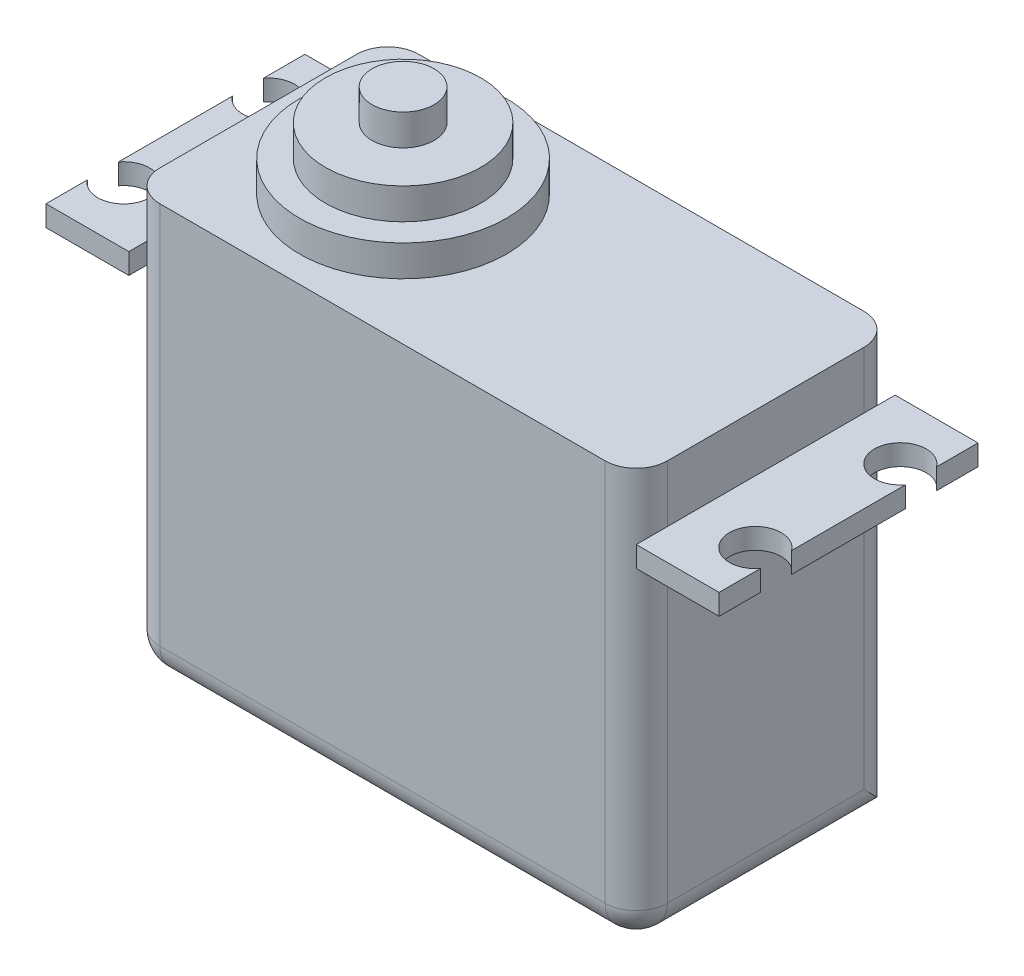
ISO-10303-21;
HEADER;
FILE_DESCRIPTION(('STEP AP214'),'2;1');
FILE_NAME('part.step','',(''),(''),'','','');
FILE_SCHEMA(('AUTOMOTIVE_DESIGN { 1 0 10303 214 1 1 1 1 }'));
ENDSEC;
DATA;
#1=APPLICATION_CONTEXT('core data for automotive mechanical design processes');
#2=APPLICATION_PROTOCOL_DEFINITION('international standard','automotive_design',2000,#1);
#3=PRODUCT_CONTEXT('',#1,'mechanical');
#4=PRODUCT('Part','Part','',(#3));
#5=PRODUCT_RELATED_PRODUCT_CATEGORY('part','',(#4));
#6=PRODUCT_DEFINITION_FORMATION('','',#4);
#7=PRODUCT_DEFINITION_CONTEXT('part definition',#1,'design');
#8=PRODUCT_DEFINITION('design','',#6,#7);
#9=PRODUCT_DEFINITION_SHAPE('','',#8);
#10=(LENGTH_UNIT() NAMED_UNIT(*) SI_UNIT(.MILLI.,.METRE.));
#11=(NAMED_UNIT(*) PLANE_ANGLE_UNIT() SI_UNIT($,.RADIAN.));
#12=(NAMED_UNIT(*) SI_UNIT($,.STERADIAN.) SOLID_ANGLE_UNIT());
#13=UNCERTAINTY_MEASURE_WITH_UNIT(LENGTH_MEASURE(1.E-05),#10,'distance_accuracy_value','');
#14=(GEOMETRIC_REPRESENTATION_CONTEXT(3) GLOBAL_UNCERTAINTY_ASSIGNED_CONTEXT((#13)) GLOBAL_UNIT_ASSIGNED_CONTEXT((#10,
#11,#12)) REPRESENTATION_CONTEXT('',''));
#15=CARTESIAN_POINT('',(0.,0.,0.));
#16=DIRECTION('',(0.,0.,1.));
#17=DIRECTION('',(1.,0.,0.));
#18=AXIS2_PLACEMENT_3D('',#15,#16,#17);
#19=CARTESIAN_POINT('',(24.5,-20.,25.));
#20=DIRECTION('',(-1.,0.,0.));
#21=DIRECTION('',(0.,0.,1.));
#22=AXIS2_PLACEMENT_3D('',#19,#20,#21);
#23=PLANE('',#22);
#24=DIRECTION('',(0.,0.,1.));
#25=VECTOR('',#24,1.);
#26=CARTESIAN_POINT('',(24.5,14.5,0.));
#27=LINE('',#26,#25);
#28=CARTESIAN_POINT('',(24.5,14.5,3.));
#29=VERTEX_POINT('',#28);
#30=CARTESIAN_POINT('',(24.5,14.5,22.));
#31=VERTEX_POINT('',#30);
#32=EDGE_CURVE('E281',#29,#31,#27,.T.);
#33=ORIENTED_EDGE('',*,*,#32,.F.);
#34=DIRECTION('',(0.,1.,0.));
#35=VECTOR('',#34,1.);
#36=CARTESIAN_POINT('',(24.5,-20.,3.));
#37=LINE('',#36,#35);
#38=CARTESIAN_POINT('',(24.5,20.,3.));
#39=VERTEX_POINT('',#38);
#40=EDGE_CURVE('E420',#29,#39,#37,.T.);
#41=ORIENTED_EDGE('',*,*,#40,.T.);
#42=DIRECTION('',(0.,0.,-1.));
#43=VECTOR('',#42,1.);
#44=CARTESIAN_POINT('',(24.5,20.,25.));
#45=LINE('',#44,#43);
#46=CARTESIAN_POINT('',(24.5,20.,22.));
#47=VERTEX_POINT('',#46);
#48=EDGE_CURVE('E408',#47,#39,#45,.T.);
#49=ORIENTED_EDGE('',*,*,#48,.F.);
#50=DIRECTION('',(0.,1.,0.));
#51=VECTOR('',#50,1.);
#52=CARTESIAN_POINT('',(24.5,-20.,22.));
#53=LINE('',#52,#51);
#54=EDGE_CURVE('E415',#47,#31,#53,.F.);
#55=ORIENTED_EDGE('',*,*,#54,.T.);
#56=EDGE_LOOP('',(#33,#41,#49,#55));
#57=FACE_BOUND('',#56,.T.);
#58=ADVANCED_FACE('F35',(#57),#23,.F.);
#59=CARTESIAN_POINT('',(-24.5,-20.,25.));
#60=DIRECTION('',(1.,0.,0.));
#61=DIRECTION('',(0.,0.,-1.));
#62=AXIS2_PLACEMENT_3D('',#59,#60,#61);
#63=PLANE('',#62);
#64=DIRECTION('',(0.,0.,-1.));
#65=VECTOR('',#64,1.);
#66=CARTESIAN_POINT('',(-24.5,14.5,0.));
#67=LINE('',#66,#65);
#68=CARTESIAN_POINT('',(-24.5,14.5,22.));
#69=VERTEX_POINT('',#68);
#70=CARTESIAN_POINT('',(-24.5,14.5,3.));
#71=VERTEX_POINT('',#70);
#72=EDGE_CURVE('E341',#69,#71,#67,.T.);
#73=ORIENTED_EDGE('',*,*,#72,.F.);
#74=DIRECTION('',(0.,-1.,0.));
#75=VECTOR('',#74,1.);
#76=CARTESIAN_POINT('',(-24.5,20.,22.));
#77=LINE('',#76,#75);
#78=CARTESIAN_POINT('',(-24.5,20.,22.));
#79=VERTEX_POINT('',#78);
#80=EDGE_CURVE('E442',#69,#79,#77,.F.);
#81=ORIENTED_EDGE('',*,*,#80,.T.);
#82=DIRECTION('',(0.,0.,-1.));
#83=VECTOR('',#82,1.);
#84=CARTESIAN_POINT('',(-24.5,20.,25.));
#85=LINE('',#84,#83);
#86=CARTESIAN_POINT('',(-24.5,20.,3.));
#87=VERTEX_POINT('',#86);
#88=EDGE_CURVE('E400',#79,#87,#85,.T.);
#89=ORIENTED_EDGE('',*,*,#88,.T.);
#90=DIRECTION('',(0.,-1.,0.));
#91=VECTOR('',#90,1.);
#92=CARTESIAN_POINT('',(-24.5,-20.,3.));
#93=LINE('',#92,#91);
#94=EDGE_CURVE('E450',#87,#71,#93,.T.);
#95=ORIENTED_EDGE('',*,*,#94,.T.);
#96=EDGE_LOOP('',(#73,#81,#89,#95));
#97=FACE_BOUND('',#96,.T.);
#98=ADVANCED_FACE('F570',(#97),#63,.F.);
#99=CARTESIAN_POINT('',(-24.5,-17.,22.));
#100=VERTEX_POINT('',#99);
#101=CARTESIAN_POINT('',(-24.5,12.5,22.));
#102=VERTEX_POINT('',#101);
#103=EDGE_CURVE('E443',#100,#102,#77,.F.);
#104=ORIENTED_EDGE('',*,*,#103,.T.);
#105=DIRECTION('',(0.,0.,-1.));
#106=VECTOR('',#105,1.);
#107=CARTESIAN_POINT('',(-24.5,12.5,0.));
#108=LINE('',#107,#106);
#109=CARTESIAN_POINT('',(-24.5,12.5,3.));
#110=VERTEX_POINT('',#109);
#111=EDGE_CURVE('E314',#102,#110,#108,.T.);
#112=ORIENTED_EDGE('',*,*,#111,.T.);
#113=CARTESIAN_POINT('',(-24.5,-17.,3.));
#114=VERTEX_POINT('',#113);
#115=EDGE_CURVE('E449',#110,#114,#93,.T.);
#116=ORIENTED_EDGE('',*,*,#115,.T.);
#117=DIRECTION('',(0.,0.,-1.));
#118=VECTOR('',#117,1.);
#119=CARTESIAN_POINT('',(-24.5,-17.,25.));
#120=LINE('',#119,#118);
#121=EDGE_CURVE('E446',#114,#100,#120,.F.);
#122=ORIENTED_EDGE('',*,*,#121,.T.);
#123=EDGE_LOOP('',(#104,#112,#116,#122));
#124=FACE_BOUND('',#123,.T.);
#125=ADVANCED_FACE('F528',(#124),#63,.F.);
#126=CARTESIAN_POINT('',(24.5,-20.,25.));
#127=DIRECTION('',(0.,1.,0.));
#128=DIRECTION('',(-1.,0.,0.));
#129=AXIS2_PLACEMENT_3D('',#126,#127,#128);
#130=PLANE('',#129);
#131=DIRECTION('',(1.,0.,0.));
#132=VECTOR('',#131,1.);
#133=CARTESIAN_POINT('',(24.5,-20.,0.));
#134=LINE('',#133,#132);
#135=CARTESIAN_POINT('',(-21.5,-20.,0.));
#136=VERTEX_POINT('',#135);
#137=CARTESIAN_POINT('',(21.5,-20.,0.));
#138=VERTEX_POINT('',#137);
#139=EDGE_CURVE('E396',#136,#138,#134,.T.);
#140=ORIENTED_EDGE('',*,*,#139,.T.);
#141=DIRECTION('',(0.,0.,-1.));
#142=VECTOR('',#141,1.);
#143=CARTESIAN_POINT('',(21.5,-20.,25.));
#144=LINE('',#143,#142);
#145=CARTESIAN_POINT('',(21.5,-20.,22.));
#146=VERTEX_POINT('',#145);
#147=EDGE_CURVE('E428',#138,#146,#144,.F.);
#148=ORIENTED_EDGE('',*,*,#147,.T.);
#149=DIRECTION('',(1.,0.,0.));
#150=VECTOR('',#149,1.);
#151=CARTESIAN_POINT('',(-24.5,-20.,22.));
#152=LINE('',#151,#150);
#153=CARTESIAN_POINT('',(-21.5,-20.,22.));
#154=VERTEX_POINT('',#153);
#155=EDGE_CURVE('E423',#146,#154,#152,.F.);
#156=ORIENTED_EDGE('',*,*,#155,.T.);
#157=DIRECTION('',(0.,0.,-1.));
#158=VECTOR('',#157,1.);
#159=CARTESIAN_POINT('',(-21.5,-20.,25.));
#160=LINE('',#159,#158);
#161=EDGE_CURVE('E426',#154,#136,#160,.T.);
#162=ORIENTED_EDGE('',*,*,#161,.T.);
#163=EDGE_LOOP('',(#140,#148,#156,#162));
#164=FACE_BOUND('',#163,.T.);
#165=ADVANCED_FACE('F505',(#164),#130,.F.);
#166=CARTESIAN_POINT('',(24.5,-17.,3.));
#167=VERTEX_POINT('',#166);
#168=CARTESIAN_POINT('',(24.5,12.5,3.));
#169=VERTEX_POINT('',#168);
#170=EDGE_CURVE('E421',#167,#169,#37,.T.);
#171=ORIENTED_EDGE('',*,*,#170,.T.);
#172=DIRECTION('',(0.,0.,1.));
#173=VECTOR('',#172,1.);
#174=CARTESIAN_POINT('',(24.5,12.5,0.));
#175=LINE('',#174,#173);
#176=CARTESIAN_POINT('',(24.5,12.5,22.));
#177=VERTEX_POINT('',#176);
#178=EDGE_CURVE('E52',#169,#177,#175,.T.);
#179=ORIENTED_EDGE('',*,*,#178,.T.);
#180=CARTESIAN_POINT('',(24.5,-17.,22.));
#181=VERTEX_POINT('',#180);
#182=EDGE_CURVE('E414',#177,#181,#53,.F.);
#183=ORIENTED_EDGE('',*,*,#182,.T.);
#184=DIRECTION('',(0.,0.,-1.));
#185=VECTOR('',#184,1.);
#186=CARTESIAN_POINT('',(24.5,-17.,25.));
#187=LINE('',#186,#185);
#188=EDGE_CURVE('E417',#181,#167,#187,.T.);
#189=ORIENTED_EDGE('',*,*,#188,.T.);
#190=EDGE_LOOP('',(#171,#179,#183,#189));
#191=FACE_BOUND('',#190,.T.);
#192=ADVANCED_FACE('F620',(#191),#23,.F.);
#193=CARTESIAN_POINT('',(24.5,20.,25.));
#194=DIRECTION('',(0.,-1.,0.));
#195=DIRECTION('',(1.,0.,0.));
#196=AXIS2_PLACEMENT_3D('',#193,#194,#195);
#197=PLANE('',#196);
#198=CARTESIAN_POINT('',(-10.5481960435598,20.,12.4687923193977));
#199=DIRECTION('',(0.,-1.,0.));
#200=DIRECTION('',(1.,0.,0.));
#201=AXIS2_PLACEMENT_3D('',#198,#199,#200);
#202=CIRCLE('',#201,10.);
#203=CARTESIAN_POINT('',(-0.548196043559839,20.,12.4687923193977));
#204=VERTEX_POINT('',#203);
#205=EDGE_CURVE('E411',#204,#204,#202,.F.);
#206=ORIENTED_EDGE('',*,*,#205,.F.);
#207=EDGE_LOOP('',(#206));
#208=FACE_BOUND('',#207,.T.);
#209=ORIENTED_EDGE('',*,*,#48,.T.);
#210=CARTESIAN_POINT('',(21.5,20.,3.));
#211=DIRECTION('',(0.,-1.,0.));
#212=DIRECTION('',(1.,0.,0.));
#213=AXIS2_PLACEMENT_3D('',#210,#211,#212);
#214=CIRCLE('',#213,3.);
#215=CARTESIAN_POINT('',(21.5,20.,0.));
#216=VERTEX_POINT('',#215);
#217=EDGE_CURVE('E436',#39,#216,#214,.F.);
#218=ORIENTED_EDGE('',*,*,#217,.T.);
#219=DIRECTION('',(-1.,0.,0.));
#220=VECTOR('',#219,1.);
#221=CARTESIAN_POINT('',(24.5,20.,0.));
#222=LINE('',#221,#220);
#223=CARTESIAN_POINT('',(-21.5,20.,0.));
#224=VERTEX_POINT('',#223);
#225=EDGE_CURVE('E401',#216,#224,#222,.T.);
#226=ORIENTED_EDGE('',*,*,#225,.T.);
#227=CARTESIAN_POINT('',(-21.5,20.,3.));
#228=DIRECTION('',(0.,-1.,0.));
#229=DIRECTION('',(1.,0.,0.));
#230=AXIS2_PLACEMENT_3D('',#227,#228,#229);
#231=CIRCLE('',#230,3.);
#232=EDGE_CURVE('E434',#224,#87,#231,.F.);
#233=ORIENTED_EDGE('',*,*,#232,.T.);
#234=ORIENTED_EDGE('',*,*,#88,.F.);
#235=CARTESIAN_POINT('',(-21.5,20.,22.));
#236=DIRECTION('',(0.,-1.,0.));
#237=DIRECTION('',(1.,0.,0.));
#238=AXIS2_PLACEMENT_3D('',#235,#236,#237);
#239=CIRCLE('',#238,3.);
#240=CARTESIAN_POINT('',(-21.5,20.,25.));
#241=VERTEX_POINT('',#240);
#242=EDGE_CURVE('E430',#79,#241,#239,.F.);
#243=ORIENTED_EDGE('',*,*,#242,.T.);
#244=DIRECTION('',(-1.,0.,0.));
#245=VECTOR('',#244,1.);
#246=CARTESIAN_POINT('',(24.5,20.,25.));
#247=LINE('',#246,#245);
#248=CARTESIAN_POINT('',(21.5,20.,25.));
#249=VERTEX_POINT('',#248);
#250=EDGE_CURVE('E397',#249,#241,#247,.T.);
#251=ORIENTED_EDGE('',*,*,#250,.F.);
#252=CARTESIAN_POINT('',(21.5,20.,22.));
#253=DIRECTION('',(0.,-1.,0.));
#254=DIRECTION('',(1.,0.,0.));
#255=AXIS2_PLACEMENT_3D('',#252,#253,#254);
#256=CIRCLE('',#255,3.);
#257=EDGE_CURVE('E432',#249,#47,#256,.F.);
#258=ORIENTED_EDGE('',*,*,#257,.T.);
#259=EDGE_LOOP('',(#209,#218,#226,#233,#234,#243,#251,#258));
#260=FACE_BOUND('',#259,.T.);
#261=ADVANCED_FACE('F494',(#208,#260),#197,.F.);
#262=CARTESIAN_POINT('',(0.,0.,25.));
#263=DIRECTION('',(0.,0.,1.));
#264=DIRECTION('',(1.,0.,0.));
#265=AXIS2_PLACEMENT_3D('',#262,#263,#264);
#266=PLANE('',#265);
#267=DIRECTION('',(1.,0.,0.));
#268=VECTOR('',#267,1.);
#269=CARTESIAN_POINT('',(24.5,-17.,25.));
#270=LINE('',#269,#268);
#271=CARTESIAN_POINT('',(-21.5,-17.,25.));
#272=VERTEX_POINT('',#271);
#273=CARTESIAN_POINT('',(21.5,-17.,25.));
#274=VERTEX_POINT('',#273);
#275=EDGE_CURVE('E44',#272,#274,#270,.T.);
#276=ORIENTED_EDGE('',*,*,#275,.T.);
#277=DIRECTION('',(0.,1.,0.));
#278=VECTOR('',#277,1.);
#279=CARTESIAN_POINT('',(21.5,20.,25.));
#280=LINE('',#279,#278);
#281=EDGE_CURVE('E11',#274,#249,#280,.T.);
#282=ORIENTED_EDGE('',*,*,#281,.T.);
#283=ORIENTED_EDGE('',*,*,#250,.T.);
#284=DIRECTION('',(0.,-1.,0.));
#285=VECTOR('',#284,1.);
#286=CARTESIAN_POINT('',(-21.5,-20.,25.));
#287=LINE('',#286,#285);
#288=EDGE_CURVE('E453',#241,#272,#287,.T.);
#289=ORIENTED_EDGE('',*,*,#288,.T.);
#290=EDGE_LOOP('',(#276,#282,#283,#289));
#291=FACE_BOUND('',#290,.T.);
#292=ADVANCED_FACE('F574',(#291),#266,.T.);
#293=CARTESIAN_POINT('',(0.,0.,0.));
#294=DIRECTION('',(0.,0.,1.));
#295=DIRECTION('',(1.,0.,0.));
#296=AXIS2_PLACEMENT_3D('',#293,#294,#295);
#297=PLANE('',#296);
#298=ORIENTED_EDGE('',*,*,#225,.F.);
#299=DIRECTION('',(0.,1.,0.));
#300=VECTOR('',#299,1.);
#301=CARTESIAN_POINT('',(21.5,0.,0.));
#302=LINE('',#301,#300);
#303=EDGE_CURVE('E440',#216,#138,#302,.F.);
#304=ORIENTED_EDGE('',*,*,#303,.T.);
#305=ORIENTED_EDGE('',*,*,#139,.F.);
#306=DIRECTION('',(0.,-1.,0.));
#307=VECTOR('',#306,1.);
#308=CARTESIAN_POINT('',(-21.5,0.,0.));
#309=LINE('',#308,#307);
#310=EDGE_CURVE('E438',#136,#224,#309,.F.);
#311=ORIENTED_EDGE('',*,*,#310,.T.);
#312=EDGE_LOOP('',(#298,#304,#305,#311));
#313=FACE_BOUND('',#312,.T.);
#314=ADVANCED_FACE('F491',(#313),#297,.F.);
#315=CARTESIAN_POINT('',(-10.5481960435598,23.,12.4687923193977));
#316=DIRECTION('',(0.,-1.,0.));
#317=DIRECTION('',(1.,0.,0.));
#318=AXIS2_PLACEMENT_3D('',#315,#316,#317);
#319=CYLINDRICAL_SURFACE('',#318,10.);
#320=CARTESIAN_POINT('',(-10.5481960435598,23.,12.4687923193977));
#321=DIRECTION('',(0.,1.,0.));
#322=DIRECTION('',(-1.,0.,0.));
#323=AXIS2_PLACEMENT_3D('',#320,#321,#322);
#324=CIRCLE('',#323,10.);
#325=CARTESIAN_POINT('',(-20.5481960435598,23.,12.4687923193977));
#326=VERTEX_POINT('',#325);
#327=EDGE_CURVE('E391',#326,#326,#324,.T.);
#328=ORIENTED_EDGE('',*,*,#327,.F.);
#329=EDGE_LOOP('',(#328));
#330=FACE_BOUND('',#329,.T.);
#331=ORIENTED_EDGE('',*,*,#205,.T.);
#332=EDGE_LOOP('',(#331));
#333=FACE_BOUND('',#332,.T.);
#334=ADVANCED_FACE('F683',(#330,#333),#319,.T.);
#335=CARTESIAN_POINT('',(-10.5481960435598,23.,12.4687923193977));
#336=DIRECTION('',(0.,1.,0.));
#337=DIRECTION('',(-1.,0.,0.));
#338=AXIS2_PLACEMENT_3D('',#335,#336,#337);
#339=PLANE('',#338);
#340=CARTESIAN_POINT('',(-10.5481960435598,23.,12.4687923193977));
#341=DIRECTION('',(0.,1.,0.));
#342=DIRECTION('',(-1.,0.,0.));
#343=AXIS2_PLACEMENT_3D('',#340,#341,#342);
#344=CIRCLE('',#343,7.5);
#345=CARTESIAN_POINT('',(-18.0481960435598,23.,12.4687923193977));
#346=VERTEX_POINT('',#345);
#347=EDGE_CURVE('E384',#346,#346,#344,.T.);
#348=ORIENTED_EDGE('',*,*,#347,.F.);
#349=EDGE_LOOP('',(#348));
#350=FACE_BOUND('',#349,.T.);
#351=ORIENTED_EDGE('',*,*,#327,.T.);
#352=EDGE_LOOP('',(#351));
#353=FACE_BOUND('',#352,.T.);
#354=ADVANCED_FACE('F679',(#350,#353),#339,.T.);
#355=CARTESIAN_POINT('',(-10.5481960435598,26.,12.4687923193977));
#356=DIRECTION('',(0.,-1.,0.));
#357=DIRECTION('',(1.,0.,0.));
#358=AXIS2_PLACEMENT_3D('',#355,#356,#357);
#359=CYLINDRICAL_SURFACE('',#358,7.5);
#360=CARTESIAN_POINT('',(-10.5481960435598,26.,12.4687923193977));
#361=DIRECTION('',(0.,1.,0.));
#362=DIRECTION('',(-1.,0.,0.));
#363=AXIS2_PLACEMENT_3D('',#360,#361,#362);
#364=CIRCLE('',#363,7.5);
#365=CARTESIAN_POINT('',(-18.0481960435598,26.,12.4687923193977));
#366=VERTEX_POINT('',#365);
#367=EDGE_CURVE('E388',#366,#366,#364,.T.);
#368=ORIENTED_EDGE('',*,*,#367,.F.);
#369=EDGE_LOOP('',(#368));
#370=FACE_BOUND('',#369,.T.);
#371=ORIENTED_EDGE('',*,*,#347,.T.);
#372=EDGE_LOOP('',(#371));
#373=FACE_BOUND('',#372,.T.);
#374=ADVANCED_FACE('F675',(#370,#373),#359,.T.);
#375=CARTESIAN_POINT('',(-10.5481960435598,26.,12.4687923193977));
#376=DIRECTION('',(0.,1.,0.));
#377=DIRECTION('',(-1.,0.,0.));
#378=AXIS2_PLACEMENT_3D('',#375,#376,#377);
#379=PLANE('',#378);
#380=CARTESIAN_POINT('',(-10.5481960435598,26.,12.4687923193977));
#381=DIRECTION('',(0.,1.,0.));
#382=DIRECTION('',(-1.,0.,0.));
#383=AXIS2_PLACEMENT_3D('',#380,#381,#382);
#384=CIRCLE('',#383,3.);
#385=CARTESIAN_POINT('',(-13.5481960435598,26.,12.4687923193977));
#386=VERTEX_POINT('',#385);
#387=EDGE_CURVE('E385',#386,#386,#384,.T.);
#388=ORIENTED_EDGE('',*,*,#387,.F.);
#389=EDGE_LOOP('',(#388));
#390=FACE_BOUND('',#389,.T.);
#391=ORIENTED_EDGE('',*,*,#367,.T.);
#392=EDGE_LOOP('',(#391));
#393=FACE_BOUND('',#392,.T.);
#394=ADVANCED_FACE('F667',(#390,#393),#379,.T.);
#395=CARTESIAN_POINT('',(-10.5481960435598,29.,12.4687923193977));
#396=DIRECTION('',(0.,-1.,0.));
#397=DIRECTION('',(1.,0.,0.));
#398=AXIS2_PLACEMENT_3D('',#395,#396,#397);
#399=CYLINDRICAL_SURFACE('',#398,3.);
#400=CARTESIAN_POINT('',(-10.5481960435598,29.,12.4687923193977));
#401=DIRECTION('',(0.,1.,0.));
#402=DIRECTION('',(-1.,0.,0.));
#403=AXIS2_PLACEMENT_3D('',#400,#401,#402);
#404=CIRCLE('',#403,3.);
#405=CARTESIAN_POINT('',(-13.5481960435598,29.,12.4687923193977));
#406=VERTEX_POINT('',#405);
#407=EDGE_CURVE('E381',#406,#406,#404,.T.);
#408=ORIENTED_EDGE('',*,*,#407,.F.);
#409=EDGE_LOOP('',(#408));
#410=FACE_BOUND('',#409,.T.);
#411=ORIENTED_EDGE('',*,*,#387,.T.);
#412=EDGE_LOOP('',(#411));
#413=FACE_BOUND('',#412,.T.);
#414=ADVANCED_FACE('F661',(#410,#413),#399,.T.);
#415=CARTESIAN_POINT('',(-10.5481960435598,29.,12.4687923193977));
#416=DIRECTION('',(0.,1.,0.));
#417=DIRECTION('',(-1.,0.,0.));
#418=AXIS2_PLACEMENT_3D('',#415,#416,#417);
#419=PLANE('',#418);
#420=ORIENTED_EDGE('',*,*,#407,.T.);
#421=EDGE_LOOP('',(#420));
#422=FACE_BOUND('',#421,.T.);
#423=ADVANCED_FACE('F657',(#422),#419,.T.);
#424=CARTESIAN_POINT('',(-21.5,-20.,3.));
#425=DIRECTION('',(0.,-1.,0.));
#426=DIRECTION('',(0.,0.,-1.));
#427=AXIS2_PLACEMENT_3D('',#424,#425,#426);
#428=CYLINDRICAL_SURFACE('',#427,3.);
#429=ORIENTED_EDGE('',*,*,#232,.F.);
#430=ORIENTED_EDGE('',*,*,#310,.F.);
#431=CARTESIAN_POINT('',(-21.5,-17.,3.));
#432=DIRECTION('',(0.,-0.707106781186547,0.707106781186547));
#433=DIRECTION('',(0.,-0.707106781186547,-0.707106781186547));
#434=AXIS2_PLACEMENT_3D('',#431,#432,#433);
#435=ELLIPSE('',#434,4.24264068711928,3.);
#436=EDGE_CURVE('E39',#114,#136,#435,.T.);
#437=ORIENTED_EDGE('',*,*,#436,.F.);
#438=ORIENTED_EDGE('',*,*,#115,.F.);
#439=DIRECTION('',(0.,-1.,0.));
#440=VECTOR('',#439,1.);
#441=CARTESIAN_POINT('',(-24.5,-20.,3.));
#442=LINE('',#441,#440);
#443=EDGE_CURVE('E364',#110,#71,#442,.F.);
#444=ORIENTED_EDGE('',*,*,#443,.T.);
#445=ORIENTED_EDGE('',*,*,#94,.F.);
#446=EDGE_LOOP('',(#429,#430,#437,#438,#444,#445));
#447=FACE_BOUND('',#446,.T.);
#448=ADVANCED_FACE('F37',(#447),#428,.T.);
#449=CARTESIAN_POINT('',(-21.5,-17.,25.));
#450=DIRECTION('',(0.,0.,-1.));
#451=DIRECTION('',(-1.,0.,0.));
#452=AXIS2_PLACEMENT_3D('',#449,#450,#451);
#453=CYLINDRICAL_SURFACE('',#452,3.);
#454=ORIENTED_EDGE('',*,*,#436,.T.);
#455=ORIENTED_EDGE('',*,*,#161,.F.);
#456=CARTESIAN_POINT('',(-21.5,-17.,22.));
#457=DIRECTION('',(0.,0.,1.));
#458=DIRECTION('',(1.,0.,0.));
#459=AXIS2_PLACEMENT_3D('',#456,#457,#458);
#460=CIRCLE('',#459,3.);
#461=EDGE_CURVE('E471',#100,#154,#460,.T.);
#462=ORIENTED_EDGE('',*,*,#461,.F.);
#463=ORIENTED_EDGE('',*,*,#121,.F.);
#464=EDGE_LOOP('',(#454,#455,#462,#463));
#465=FACE_BOUND('',#464,.T.);
#466=ADVANCED_FACE('F481',(#465),#453,.T.);
#467=CARTESIAN_POINT('',(-21.5,0.,22.));
#468=DIRECTION('',(0.,1.,0.));
#469=DIRECTION('',(0.,0.,1.));
#470=AXIS2_PLACEMENT_3D('',#467,#468,#469);
#471=CYLINDRICAL_SURFACE('',#470,3.);
#472=ORIENTED_EDGE('',*,*,#242,.F.);
#473=ORIENTED_EDGE('',*,*,#80,.F.);
#474=EDGE_CURVE('E447',#102,#69,#77,.F.);
#475=ORIENTED_EDGE('',*,*,#474,.F.);
#476=ORIENTED_EDGE('',*,*,#103,.F.);
#477=CARTESIAN_POINT('',(-21.5,-17.,22.));
#478=DIRECTION('',(0.,-1.,0.));
#479=DIRECTION('',(0.,0.,-1.));
#480=AXIS2_PLACEMENT_3D('',#477,#478,#479);
#481=CIRCLE('',#480,3.);
#482=EDGE_CURVE('E469',#272,#100,#481,.T.);
#483=ORIENTED_EDGE('',*,*,#482,.F.);
#484=ORIENTED_EDGE('',*,*,#288,.F.);
#485=EDGE_LOOP('',(#472,#473,#475,#476,#483,#484));
#486=FACE_BOUND('',#485,.T.);
#487=ADVANCED_FACE('F524',(#486),#471,.T.);
#488=CARTESIAN_POINT('',(-21.5,-17.,22.));
#489=DIRECTION('',(0.,0.,1.));
#490=DIRECTION('',(1.,0.,0.));
#491=AXIS2_PLACEMENT_3D('',#488,#489,#490);
#492=SPHERICAL_SURFACE('',#491,3.);
#493=ORIENTED_EDGE('',*,*,#482,.T.);
#494=ORIENTED_EDGE('',*,*,#461,.T.);
#495=CARTESIAN_POINT('',(-21.5,-17.,22.));
#496=DIRECTION('',(-1.,0.,0.));
#497=DIRECTION('',(0.,0.,1.));
#498=AXIS2_PLACEMENT_3D('',#495,#496,#497);
#499=CIRCLE('',#498,3.);
#500=EDGE_CURVE('E466',#272,#154,#499,.F.);
#501=ORIENTED_EDGE('',*,*,#500,.F.);
#502=EDGE_LOOP('',(#493,#494,#501));
#503=FACE_BOUND('',#502,.T.);
#504=ADVANCED_FACE('F518',(#503),#492,.T.);
#505=CARTESIAN_POINT('',(0.,-17.,22.));
#506=DIRECTION('',(-1.,0.,0.));
#507=DIRECTION('',(0.,-1.,0.));
#508=AXIS2_PLACEMENT_3D('',#505,#506,#507);
#509=CYLINDRICAL_SURFACE('',#508,3.);
#510=ORIENTED_EDGE('',*,*,#500,.T.);
#511=ORIENTED_EDGE('',*,*,#155,.F.);
#512=CARTESIAN_POINT('',(21.5,-17.,22.));
#513=DIRECTION('',(1.,0.,0.));
#514=DIRECTION('',(0.,0.,-1.));
#515=AXIS2_PLACEMENT_3D('',#512,#513,#514);
#516=CIRCLE('',#515,3.);
#517=EDGE_CURVE('E463',#274,#146,#516,.T.);
#518=ORIENTED_EDGE('',*,*,#517,.F.);
#519=ORIENTED_EDGE('',*,*,#275,.F.);
#520=EDGE_LOOP('',(#510,#511,#518,#519));
#521=FACE_BOUND('',#520,.T.);
#522=ADVANCED_FACE('F517',(#521),#509,.T.);
#523=CARTESIAN_POINT('',(21.5,0.,22.));
#524=DIRECTION('',(0.,-1.,0.));
#525=DIRECTION('',(0.,0.,-1.));
#526=AXIS2_PLACEMENT_3D('',#523,#524,#525);
#527=CYLINDRICAL_SURFACE('',#526,3.);
#528=ORIENTED_EDGE('',*,*,#257,.F.);
#529=ORIENTED_EDGE('',*,*,#281,.F.);
#530=CARTESIAN_POINT('',(21.5,-17.,22.));
#531=DIRECTION('',(0.,-1.,0.));
#532=DIRECTION('',(0.,0.,-1.));
#533=AXIS2_PLACEMENT_3D('',#530,#531,#532);
#534=CIRCLE('',#533,3.);
#535=EDGE_CURVE('E460',#181,#274,#534,.T.);
#536=ORIENTED_EDGE('',*,*,#535,.F.);
#537=ORIENTED_EDGE('',*,*,#182,.F.);
#538=DIRECTION('',(0.,-1.,0.));
#539=VECTOR('',#538,1.);
#540=CARTESIAN_POINT('',(24.5,0.,22.));
#541=LINE('',#540,#539);
#542=EDGE_CURVE('E59',#177,#31,#541,.F.);
#543=ORIENTED_EDGE('',*,*,#542,.T.);
#544=ORIENTED_EDGE('',*,*,#54,.F.);
#545=EDGE_LOOP('',(#528,#529,#536,#537,#543,#544));
#546=FACE_BOUND('',#545,.T.);
#547=ADVANCED_FACE('F576',(#546),#527,.T.);
#548=CARTESIAN_POINT('',(21.5,-17.,22.));
#549=DIRECTION('',(0.,0.,1.));
#550=DIRECTION('',(1.,0.,0.));
#551=AXIS2_PLACEMENT_3D('',#548,#549,#550);
#552=SPHERICAL_SURFACE('',#551,3.);
#553=ORIENTED_EDGE('',*,*,#535,.T.);
#554=ORIENTED_EDGE('',*,*,#517,.T.);
#555=CARTESIAN_POINT('',(21.5,-17.,22.));
#556=DIRECTION('',(0.,0.,1.));
#557=DIRECTION('',(1.,0.,0.));
#558=AXIS2_PLACEMENT_3D('',#555,#556,#557);
#559=CIRCLE('',#558,3.);
#560=EDGE_CURVE('E457',#181,#146,#559,.F.);
#561=ORIENTED_EDGE('',*,*,#560,.F.);
#562=EDGE_LOOP('',(#553,#554,#561));
#563=FACE_BOUND('',#562,.T.);
#564=ADVANCED_FACE('F512',(#563),#552,.T.);
#565=CARTESIAN_POINT('',(21.5,-20.,3.));
#566=DIRECTION('',(0.,1.,0.));
#567=DIRECTION('',(0.,0.,1.));
#568=AXIS2_PLACEMENT_3D('',#565,#566,#567);
#569=CYLINDRICAL_SURFACE('',#568,3.);
#570=ORIENTED_EDGE('',*,*,#217,.F.);
#571=ORIENTED_EDGE('',*,*,#40,.F.);
#572=EDGE_CURVE('E424',#169,#29,#37,.T.);
#573=ORIENTED_EDGE('',*,*,#572,.F.);
#574=ORIENTED_EDGE('',*,*,#170,.F.);
#575=CARTESIAN_POINT('',(21.5,-17.,3.));
#576=DIRECTION('',(0.,0.707106781186547,-0.707106781186547));
#577=DIRECTION('',(0.,0.707106781186547,0.707106781186547));
#578=AXIS2_PLACEMENT_3D('',#575,#576,#577);
#579=ELLIPSE('',#578,4.24264068711928,3.);
#580=EDGE_CURVE('E380',#138,#167,#579,.F.);
#581=ORIENTED_EDGE('',*,*,#580,.F.);
#582=ORIENTED_EDGE('',*,*,#303,.F.);
#583=EDGE_LOOP('',(#570,#571,#573,#574,#581,#582));
#584=FACE_BOUND('',#583,.T.);
#585=ADVANCED_FACE('F499',(#584),#569,.T.);
#586=CARTESIAN_POINT('',(21.5,-17.,25.));
#587=DIRECTION('',(0.,0.,-1.));
#588=DIRECTION('',(-1.,0.,0.));
#589=AXIS2_PLACEMENT_3D('',#586,#587,#588);
#590=CYLINDRICAL_SURFACE('',#589,3.);
#591=ORIENTED_EDGE('',*,*,#560,.T.);
#592=ORIENTED_EDGE('',*,*,#147,.F.);
#593=ORIENTED_EDGE('',*,*,#580,.T.);
#594=ORIENTED_EDGE('',*,*,#188,.F.);
#595=EDGE_LOOP('',(#591,#592,#593,#594));
#596=FACE_BOUND('',#595,.T.);
#597=ADVANCED_FACE('F508',(#596),#590,.T.);
#598=CARTESIAN_POINT('',(-24.5,12.5,0.));
#599=DIRECTION('',(1.,0.,0.));
#600=DIRECTION('',(0.,1.,0.));
#601=AXIS2_PLACEMENT_3D('',#598,#599,#600);
#602=PLANE('',#601);
#603=ORIENTED_EDGE('',*,*,#443,.F.);
#604=CARTESIAN_POINT('',(-24.5,12.5,0.));
#605=VERTEX_POINT('',#604);
#606=EDGE_CURVE('E315',#110,#605,#108,.T.);
#607=ORIENTED_EDGE('',*,*,#606,.T.);
#608=DIRECTION('',(0.,1.,0.));
#609=VECTOR('',#608,1.);
#610=CARTESIAN_POINT('',(-24.5,12.5,0.));
#611=LINE('',#610,#609);
#612=CARTESIAN_POINT('',(-24.5,14.5,0.));
#613=VERTEX_POINT('',#612);
#614=EDGE_CURVE('E336',#605,#613,#611,.T.);
#615=ORIENTED_EDGE('',*,*,#614,.T.);
#616=EDGE_CURVE('E309',#71,#613,#67,.T.);
#617=ORIENTED_EDGE('',*,*,#616,.F.);
#618=EDGE_LOOP('',(#603,#607,#615,#617));
#619=FACE_BOUND('',#618,.T.);
#620=ADVANCED_FACE('F566',(#619),#602,.T.);
#621=ORIENTED_EDGE('',*,*,#474,.T.);
#622=CARTESIAN_POINT('',(-24.5,14.5,25.));
#623=VERTEX_POINT('',#622);
#624=EDGE_CURVE('E337',#623,#69,#67,.T.);
#625=ORIENTED_EDGE('',*,*,#624,.F.);
#626=DIRECTION('',(0.,1.,0.));
#627=VECTOR('',#626,1.);
#628=CARTESIAN_POINT('',(-24.5,12.5,25.));
#629=LINE('',#628,#627);
#630=CARTESIAN_POINT('',(-24.5,12.5,25.));
#631=VERTEX_POINT('',#630);
#632=EDGE_CURVE('E362',#631,#623,#629,.T.);
#633=ORIENTED_EDGE('',*,*,#632,.F.);
#634=EDGE_CURVE('E310',#631,#102,#108,.T.);
#635=ORIENTED_EDGE('',*,*,#634,.T.);
#636=EDGE_LOOP('',(#621,#625,#633,#635));
#637=FACE_BOUND('',#636,.T.);
#638=ADVANCED_FACE('F536',(#637),#602,.T.);
#639=CARTESIAN_POINT('',(-24.5,12.5,25.));
#640=DIRECTION('',(0.,0.,1.));
#641=DIRECTION('',(1.,0.,0.));
#642=AXIS2_PLACEMENT_3D('',#639,#640,#641);
#643=PLANE('',#642);
#644=DIRECTION('',(1.,0.,0.));
#645=VECTOR('',#644,1.);
#646=CARTESIAN_POINT('',(-24.5,14.5,25.));
#647=LINE('',#646,#645);
#648=CARTESIAN_POINT('',(-32.5,14.5,25.));
#649=VERTEX_POINT('',#648);
#650=EDGE_CURVE('E359',#649,#623,#647,.T.);
#651=ORIENTED_EDGE('',*,*,#650,.F.);
#652=DIRECTION('',(0.,1.,0.));
#653=VECTOR('',#652,1.);
#654=CARTESIAN_POINT('',(-32.5,12.5,25.));
#655=LINE('',#654,#653);
#656=CARTESIAN_POINT('',(-32.5,12.5,25.));
#657=VERTEX_POINT('',#656);
#658=EDGE_CURVE('E365',#657,#649,#655,.T.);
#659=ORIENTED_EDGE('',*,*,#658,.F.);
#660=DIRECTION('',(1.,0.,0.));
#661=VECTOR('',#660,1.);
#662=CARTESIAN_POINT('',(-24.5,12.5,25.));
#663=LINE('',#662,#661);
#664=EDGE_CURVE('E333',#657,#631,#663,.T.);
#665=ORIENTED_EDGE('',*,*,#664,.T.);
#666=ORIENTED_EDGE('',*,*,#632,.T.);
#667=EDGE_LOOP('',(#651,#659,#665,#666));
#668=FACE_BOUND('',#667,.T.);
#669=ADVANCED_FACE('F540',(#668),#643,.T.);
#670=CARTESIAN_POINT('',(-32.5,12.5,25.));
#671=DIRECTION('',(-1.,0.,0.));
#672=DIRECTION('',(0.,-1.,0.));
#673=AXIS2_PLACEMENT_3D('',#670,#671,#672);
#674=PLANE('',#673);
#675=DIRECTION('',(0.,0.,1.));
#676=VECTOR('',#675,1.);
#677=CARTESIAN_POINT('',(-32.5,14.5,25.));
#678=LINE('',#677,#676);
#679=CARTESIAN_POINT('',(-32.5,14.5,21.));
#680=VERTEX_POINT('',#679);
#681=EDGE_CURVE('E356',#680,#649,#678,.T.);
#682=ORIENTED_EDGE('',*,*,#681,.F.);
#683=DIRECTION('',(0.,1.,0.));
#684=VECTOR('',#683,1.);
#685=CARTESIAN_POINT('',(-32.5,12.5,21.));
#686=LINE('',#685,#684);
#687=CARTESIAN_POINT('',(-32.5,12.5,21.));
#688=VERTEX_POINT('',#687);
#689=EDGE_CURVE('E367',#688,#680,#686,.T.);
#690=ORIENTED_EDGE('',*,*,#689,.F.);
#691=DIRECTION('',(0.,0.,1.));
#692=VECTOR('',#691,1.);
#693=CARTESIAN_POINT('',(-32.5,12.5,25.));
#694=LINE('',#693,#692);
#695=EDGE_CURVE('E330',#688,#657,#694,.T.);
#696=ORIENTED_EDGE('',*,*,#695,.T.);
#697=ORIENTED_EDGE('',*,*,#658,.T.);
#698=EDGE_LOOP('',(#682,#690,#696,#697));
#699=FACE_BOUND('',#698,.T.);
#700=ADVANCED_FACE('F745',(#699),#674,.T.);
#701=CARTESIAN_POINT('',(-30.5,12.5,19.5));
#702=DIRECTION('',(0.,1.,0.));
#703=DIRECTION('',(-1.,0.,0.));
#704=AXIS2_PLACEMENT_3D('',#701,#702,#703);
#705=CYLINDRICAL_SURFACE('',#704,2.5);
#706=CARTESIAN_POINT('',(-30.5,14.5,19.5));
#707=DIRECTION('',(0.,-1.,0.));
#708=DIRECTION('',(1.,0.,0.));
#709=AXIS2_PLACEMENT_3D('',#706,#707,#708);
#710=CIRCLE('',#709,2.5);
#711=CARTESIAN_POINT('',(-32.5,14.5,18.));
#712=VERTEX_POINT('',#711);
#713=EDGE_CURVE('E353',#712,#680,#710,.T.);
#714=ORIENTED_EDGE('',*,*,#713,.F.);
#715=DIRECTION('',(0.,1.,0.));
#716=VECTOR('',#715,1.);
#717=CARTESIAN_POINT('',(-32.5,12.5,18.));
#718=LINE('',#717,#716);
#719=CARTESIAN_POINT('',(-32.5,12.5,18.));
#720=VERTEX_POINT('',#719);
#721=EDGE_CURVE('E369',#720,#712,#718,.T.);
#722=ORIENTED_EDGE('',*,*,#721,.F.);
#723=CARTESIAN_POINT('',(-30.5,12.5,19.5));
#724=DIRECTION('',(0.,-1.,0.));
#725=DIRECTION('',(1.,0.,0.));
#726=AXIS2_PLACEMENT_3D('',#723,#724,#725);
#727=CIRCLE('',#726,2.5);
#728=EDGE_CURVE('E327',#720,#688,#727,.T.);
#729=ORIENTED_EDGE('',*,*,#728,.T.);
#730=ORIENTED_EDGE('',*,*,#689,.T.);
#731=EDGE_LOOP('',(#714,#722,#729,#730));
#732=FACE_BOUND('',#731,.T.);
#733=ADVANCED_FACE('F547',(#732),#705,.F.);
#734=CARTESIAN_POINT('',(-32.5,12.5,18.));
#735=DIRECTION('',(-1.,0.,0.));
#736=DIRECTION('',(0.,-1.,0.));
#737=AXIS2_PLACEMENT_3D('',#734,#735,#736);
#738=PLANE('',#737);
#739=DIRECTION('',(0.,0.,1.));
#740=VECTOR('',#739,1.);
#741=CARTESIAN_POINT('',(-32.5,14.5,18.));
#742=LINE('',#741,#740);
#743=CARTESIAN_POINT('',(-32.5,14.5,7.));
#744=VERTEX_POINT('',#743);
#745=EDGE_CURVE('E350',#744,#712,#742,.T.);
#746=ORIENTED_EDGE('',*,*,#745,.F.);
#747=DIRECTION('',(0.,1.,0.));
#748=VECTOR('',#747,1.);
#749=CARTESIAN_POINT('',(-32.5,12.5,7.));
#750=LINE('',#749,#748);
#751=CARTESIAN_POINT('',(-32.5,12.5,7.));
#752=VERTEX_POINT('',#751);
#753=EDGE_CURVE('E371',#752,#744,#750,.T.);
#754=ORIENTED_EDGE('',*,*,#753,.F.);
#755=DIRECTION('',(0.,0.,1.));
#756=VECTOR('',#755,1.);
#757=CARTESIAN_POINT('',(-32.5,12.5,18.));
#758=LINE('',#757,#756);
#759=EDGE_CURVE('E324',#752,#720,#758,.T.);
#760=ORIENTED_EDGE('',*,*,#759,.T.);
#761=ORIENTED_EDGE('',*,*,#721,.T.);
#762=EDGE_LOOP('',(#746,#754,#760,#761));
#763=FACE_BOUND('',#762,.T.);
#764=ADVANCED_FACE('F551',(#763),#738,.T.);
#765=CARTESIAN_POINT('',(-30.5,12.5,5.5));
#766=DIRECTION('',(0.,1.,0.));
#767=DIRECTION('',(-1.,0.,0.));
#768=AXIS2_PLACEMENT_3D('',#765,#766,#767);
#769=CYLINDRICAL_SURFACE('',#768,2.5);
#770=CARTESIAN_POINT('',(-30.5,14.5,5.5));
#771=DIRECTION('',(0.,-1.,0.));
#772=DIRECTION('',(-1.,0.,0.));
#773=AXIS2_PLACEMENT_3D('',#770,#771,#772);
#774=CIRCLE('',#773,2.5);
#775=CARTESIAN_POINT('',(-32.5,14.5,4.));
#776=VERTEX_POINT('',#775);
#777=EDGE_CURVE('E347',#776,#744,#774,.T.);
#778=ORIENTED_EDGE('',*,*,#777,.F.);
#779=DIRECTION('',(0.,1.,0.));
#780=VECTOR('',#779,1.);
#781=CARTESIAN_POINT('',(-32.5,12.5,4.));
#782=LINE('',#781,#780);
#783=CARTESIAN_POINT('',(-32.5,12.5,4.));
#784=VERTEX_POINT('',#783);
#785=EDGE_CURVE('E373',#784,#776,#782,.T.);
#786=ORIENTED_EDGE('',*,*,#785,.F.);
#787=CARTESIAN_POINT('',(-30.5,12.5,5.5));
#788=DIRECTION('',(0.,-1.,0.));
#789=DIRECTION('',(-1.,0.,0.));
#790=AXIS2_PLACEMENT_3D('',#787,#788,#789);
#791=CIRCLE('',#790,2.5);
#792=EDGE_CURVE('E321',#784,#752,#791,.T.);
#793=ORIENTED_EDGE('',*,*,#792,.T.);
#794=ORIENTED_EDGE('',*,*,#753,.T.);
#795=EDGE_LOOP('',(#778,#786,#793,#794));
#796=FACE_BOUND('',#795,.T.);
#797=ADVANCED_FACE('F556',(#796),#769,.F.);
#798=CARTESIAN_POINT('',(-32.5,12.5,4.));
#799=DIRECTION('',(-1.,0.,0.));
#800=DIRECTION('',(0.,-1.,0.));
#801=AXIS2_PLACEMENT_3D('',#798,#799,#800);
#802=PLANE('',#801);
#803=DIRECTION('',(0.,0.,1.));
#804=VECTOR('',#803,1.);
#805=CARTESIAN_POINT('',(-32.5,14.5,4.));
#806=LINE('',#805,#804);
#807=CARTESIAN_POINT('',(-32.5,14.5,0.));
#808=VERTEX_POINT('',#807);
#809=EDGE_CURVE('E344',#808,#776,#806,.T.);
#810=ORIENTED_EDGE('',*,*,#809,.F.);
#811=DIRECTION('',(0.,1.,0.));
#812=VECTOR('',#811,1.);
#813=CARTESIAN_POINT('',(-32.5,12.5,0.));
#814=LINE('',#813,#812);
#815=CARTESIAN_POINT('',(-32.5,12.5,0.));
#816=VERTEX_POINT('',#815);
#817=EDGE_CURVE('E375',#816,#808,#814,.T.);
#818=ORIENTED_EDGE('',*,*,#817,.F.);
#819=DIRECTION('',(0.,0.,1.));
#820=VECTOR('',#819,1.);
#821=CARTESIAN_POINT('',(-32.5,12.5,4.));
#822=LINE('',#821,#820);
#823=EDGE_CURVE('E318',#816,#784,#822,.T.);
#824=ORIENTED_EDGE('',*,*,#823,.T.);
#825=ORIENTED_EDGE('',*,*,#785,.T.);
#826=EDGE_LOOP('',(#810,#818,#824,#825));
#827=FACE_BOUND('',#826,.T.);
#828=ADVANCED_FACE('F559',(#827),#802,.T.);
#829=CARTESIAN_POINT('',(-24.5,12.5,0.));
#830=DIRECTION('',(0.,0.,-1.));
#831=DIRECTION('',(-1.,0.,0.));
#832=AXIS2_PLACEMENT_3D('',#829,#830,#831);
#833=PLANE('',#832);
#834=DIRECTION('',(-1.,0.,0.));
#835=VECTOR('',#834,1.);
#836=CARTESIAN_POINT('',(-24.5,14.5,0.));
#837=LINE('',#836,#835);
#838=EDGE_CURVE('E340',#613,#808,#837,.T.);
#839=ORIENTED_EDGE('',*,*,#838,.F.);
#840=ORIENTED_EDGE('',*,*,#614,.F.);
#841=DIRECTION('',(-1.,0.,0.));
#842=VECTOR('',#841,1.);
#843=CARTESIAN_POINT('',(-24.5,12.5,0.));
#844=LINE('',#843,#842);
#845=EDGE_CURVE('E313',#605,#816,#844,.T.);
#846=ORIENTED_EDGE('',*,*,#845,.T.);
#847=ORIENTED_EDGE('',*,*,#817,.T.);
#848=EDGE_LOOP('',(#839,#840,#846,#847));
#849=FACE_BOUND('',#848,.T.);
#850=ADVANCED_FACE('F563',(#849),#833,.T.);
#851=CARTESIAN_POINT('',(-30.5,12.5,19.5));
#852=DIRECTION('',(0.,-1.,0.));
#853=DIRECTION('',(1.,0.,0.));
#854=AXIS2_PLACEMENT_3D('',#851,#852,#853);
#855=PLANE('',#854);
#856=ORIENTED_EDGE('',*,*,#634,.F.);
#857=ORIENTED_EDGE('',*,*,#664,.F.);
#858=ORIENTED_EDGE('',*,*,#695,.F.);
#859=ORIENTED_EDGE('',*,*,#728,.F.);
#860=ORIENTED_EDGE('',*,*,#759,.F.);
#861=ORIENTED_EDGE('',*,*,#792,.F.);
#862=ORIENTED_EDGE('',*,*,#823,.F.);
#863=ORIENTED_EDGE('',*,*,#845,.F.);
#864=ORIENTED_EDGE('',*,*,#606,.F.);
#865=ORIENTED_EDGE('',*,*,#111,.F.);
#866=EDGE_LOOP('',(#856,#857,#858,#859,#860,#861,#862,#863,#864,#865));
#867=FACE_BOUND('',#866,.T.);
#868=ADVANCED_FACE('F532',(#867),#855,.T.);
#869=CARTESIAN_POINT('',(-30.5,14.5,19.5));
#870=DIRECTION('',(0.,-1.,0.));
#871=DIRECTION('',(1.,0.,0.));
#872=AXIS2_PLACEMENT_3D('',#869,#870,#871);
#873=PLANE('',#872);
#874=ORIENTED_EDGE('',*,*,#624,.T.);
#875=ORIENTED_EDGE('',*,*,#72,.T.);
#876=ORIENTED_EDGE('',*,*,#616,.T.);
#877=ORIENTED_EDGE('',*,*,#838,.T.);
#878=ORIENTED_EDGE('',*,*,#809,.T.);
#879=ORIENTED_EDGE('',*,*,#777,.T.);
#880=ORIENTED_EDGE('',*,*,#745,.T.);
#881=ORIENTED_EDGE('',*,*,#713,.T.);
#882=ORIENTED_EDGE('',*,*,#681,.T.);
#883=ORIENTED_EDGE('',*,*,#650,.T.);
#884=EDGE_LOOP('',(#874,#875,#876,#877,#878,#879,#880,#881,#882,#883));
#885=FACE_BOUND('',#884,.T.);
#886=ADVANCED_FACE('F608',(#885),#873,.F.);
#887=CARTESIAN_POINT('',(24.5,12.5,0.));
#888=DIRECTION('',(-1.,0.,0.));
#889=DIRECTION('',(0.,-1.,0.));
#890=AXIS2_PLACEMENT_3D('',#887,#888,#889);
#891=PLANE('',#890);
#892=ORIENTED_EDGE('',*,*,#542,.F.);
#893=CARTESIAN_POINT('',(24.5,12.5,25.));
#894=VERTEX_POINT('',#893);
#895=EDGE_CURVE('E252',#177,#894,#175,.T.);
#896=ORIENTED_EDGE('',*,*,#895,.T.);
#897=DIRECTION('',(0.,1.,0.));
#898=VECTOR('',#897,1.);
#899=CARTESIAN_POINT('',(24.5,12.5,25.));
#900=LINE('',#899,#898);
#901=CARTESIAN_POINT('',(24.5,14.5,25.));
#902=VERTEX_POINT('',#901);
#903=EDGE_CURVE('E240',#894,#902,#900,.T.);
#904=ORIENTED_EDGE('',*,*,#903,.T.);
#905=EDGE_CURVE('E278',#31,#902,#27,.T.);
#906=ORIENTED_EDGE('',*,*,#905,.F.);
#907=EDGE_LOOP('',(#892,#896,#904,#906));
#908=FACE_BOUND('',#907,.T.);
#909=ADVANCED_FACE('F606',(#908),#891,.T.);
#910=ORIENTED_EDGE('',*,*,#572,.T.);
#911=CARTESIAN_POINT('',(24.5,14.5,0.));
#912=VERTEX_POINT('',#911);
#913=EDGE_CURVE('E235',#912,#29,#27,.T.);
#914=ORIENTED_EDGE('',*,*,#913,.F.);
#915=DIRECTION('',(0.,1.,0.));
#916=VECTOR('',#915,1.);
#917=CARTESIAN_POINT('',(24.5,12.5,0.));
#918=LINE('',#917,#916);
#919=CARTESIAN_POINT('',(24.5,12.5,0.));
#920=VERTEX_POINT('',#919);
#921=EDGE_CURVE('E229',#920,#912,#918,.T.);
#922=ORIENTED_EDGE('',*,*,#921,.F.);
#923=EDGE_CURVE('E233',#920,#169,#175,.T.);
#924=ORIENTED_EDGE('',*,*,#923,.T.);
#925=EDGE_LOOP('',(#910,#914,#922,#924));
#926=FACE_BOUND('',#925,.T.);
#927=ADVANCED_FACE('F232',(#926),#891,.T.);
#928=CARTESIAN_POINT('',(24.5,12.5,0.));
#929=DIRECTION('',(0.,0.,-1.));
#930=DIRECTION('',(-1.,0.,0.));
#931=AXIS2_PLACEMENT_3D('',#928,#929,#930);
#932=PLANE('',#931);
#933=DIRECTION('',(-1.,0.,0.));
#934=VECTOR('',#933,1.);
#935=CARTESIAN_POINT('',(24.5,14.5,0.));
#936=LINE('',#935,#934);
#937=CARTESIAN_POINT('',(32.5,14.5,0.));
#938=VERTEX_POINT('',#937);
#939=EDGE_CURVE('E276',#938,#912,#936,.T.);
#940=ORIENTED_EDGE('',*,*,#939,.F.);
#941=DIRECTION('',(0.,1.,0.));
#942=VECTOR('',#941,1.);
#943=CARTESIAN_POINT('',(32.5,12.5,0.));
#944=LINE('',#943,#942);
#945=CARTESIAN_POINT('',(32.5,12.5,0.));
#946=VERTEX_POINT('',#945);
#947=EDGE_CURVE('E254',#946,#938,#944,.T.);
#948=ORIENTED_EDGE('',*,*,#947,.F.);
#949=DIRECTION('',(-1.,0.,0.));
#950=VECTOR('',#949,1.);
#951=CARTESIAN_POINT('',(24.5,12.5,0.));
#952=LINE('',#951,#950);
#953=EDGE_CURVE('E247',#946,#920,#952,.T.);
#954=ORIENTED_EDGE('',*,*,#953,.T.);
#955=ORIENTED_EDGE('',*,*,#921,.T.);
#956=EDGE_LOOP('',(#940,#948,#954,#955));
#957=FACE_BOUND('',#956,.T.);
#958=ADVANCED_FACE('F253',(#957),#932,.T.);
#959=CARTESIAN_POINT('',(32.5,12.5,4.));
#960=DIRECTION('',(1.,0.,0.));
#961=DIRECTION('',(0.,1.,0.));
#962=AXIS2_PLACEMENT_3D('',#959,#960,#961);
#963=PLANE('',#962);
#964=DIRECTION('',(0.,0.,-1.));
#965=VECTOR('',#964,1.);
#966=CARTESIAN_POINT('',(32.5,14.5,4.));
#967=LINE('',#966,#965);
#968=CARTESIAN_POINT('',(32.5,14.5,4.));
#969=VERTEX_POINT('',#968);
#970=EDGE_CURVE('E255',#969,#938,#967,.T.);
#971=ORIENTED_EDGE('',*,*,#970,.F.);
#972=DIRECTION('',(0.,1.,0.));
#973=VECTOR('',#972,1.);
#974=CARTESIAN_POINT('',(32.5,12.5,4.));
#975=LINE('',#974,#973);
#976=CARTESIAN_POINT('',(32.5,12.5,4.));
#977=VERTEX_POINT('',#976);
#978=EDGE_CURVE('E296',#977,#969,#975,.T.);
#979=ORIENTED_EDGE('',*,*,#978,.F.);
#980=DIRECTION('',(0.,0.,-1.));
#981=VECTOR('',#980,1.);
#982=CARTESIAN_POINT('',(32.5,12.5,4.));
#983=LINE('',#982,#981);
#984=EDGE_CURVE('E241',#977,#946,#983,.T.);
#985=ORIENTED_EDGE('',*,*,#984,.T.);
#986=ORIENTED_EDGE('',*,*,#947,.T.);
#987=EDGE_LOOP('',(#971,#979,#985,#986));
#988=FACE_BOUND('',#987,.T.);
#989=ADVANCED_FACE('F585',(#988),#963,.T.);
#990=CARTESIAN_POINT('',(30.5,12.5,5.5));
#991=DIRECTION('',(0.,1.,0.));
#992=DIRECTION('',(-1.,0.,0.));
#993=AXIS2_PLACEMENT_3D('',#990,#991,#992);
#994=CYLINDRICAL_SURFACE('',#993,2.5);
#995=CARTESIAN_POINT('',(30.5,14.5,5.5));
#996=DIRECTION('',(0.,-1.,0.));
#997=DIRECTION('',(1.,0.,0.));
#998=AXIS2_PLACEMENT_3D('',#995,#996,#997);
#999=CIRCLE('',#998,2.5);
#1000=CARTESIAN_POINT('',(32.5,14.5,7.));
#1001=VERTEX_POINT('',#1000);
#1002=EDGE_CURVE('E258',#1001,#969,#999,.T.);
#1003=ORIENTED_EDGE('',*,*,#1002,.F.);
#1004=DIRECTION('',(0.,1.,0.));
#1005=VECTOR('',#1004,1.);
#1006=CARTESIAN_POINT('',(32.5,12.5,7.));
#1007=LINE('',#1006,#1005);
#1008=CARTESIAN_POINT('',(32.5,12.5,7.));
#1009=VERTEX_POINT('',#1008);
#1010=EDGE_CURVE('E298',#1009,#1001,#1007,.T.);
#1011=ORIENTED_EDGE('',*,*,#1010,.F.);
#1012=CARTESIAN_POINT('',(30.5,12.5,5.5));
#1013=DIRECTION('',(0.,-1.,0.));
#1014=DIRECTION('',(1.,0.,0.));
#1015=AXIS2_PLACEMENT_3D('',#1012,#1013,#1014);
#1016=CIRCLE('',#1015,2.5);
#1017=EDGE_CURVE('E272',#1009,#977,#1016,.T.);
#1018=ORIENTED_EDGE('',*,*,#1017,.T.);
#1019=ORIENTED_EDGE('',*,*,#978,.T.);
#1020=EDGE_LOOP('',(#1003,#1011,#1018,#1019));
#1021=FACE_BOUND('',#1020,.T.);
#1022=ADVANCED_FACE('F817',(#1021),#994,.F.);
#1023=CARTESIAN_POINT('',(32.5,12.5,18.));
#1024=DIRECTION('',(1.,0.,0.));
#1025=DIRECTION('',(0.,1.,0.));
#1026=AXIS2_PLACEMENT_3D('',#1023,#1024,#1025);
#1027=PLANE('',#1026);
#1028=DIRECTION('',(0.,0.,-1.));
#1029=VECTOR('',#1028,1.);
#1030=CARTESIAN_POINT('',(32.5,14.5,18.));
#1031=LINE('',#1030,#1029);
#1032=CARTESIAN_POINT('',(32.5,14.5,18.));
#1033=VERTEX_POINT('',#1032);
#1034=EDGE_CURVE('E290',#1033,#1001,#1031,.T.);
#1035=ORIENTED_EDGE('',*,*,#1034,.F.);
#1036=DIRECTION('',(0.,1.,0.));
#1037=VECTOR('',#1036,1.);
#1038=CARTESIAN_POINT('',(32.5,12.5,18.));
#1039=LINE('',#1038,#1037);
#1040=CARTESIAN_POINT('',(32.5,12.5,18.));
#1041=VERTEX_POINT('',#1040);
#1042=EDGE_CURVE('E300',#1041,#1033,#1039,.T.);
#1043=ORIENTED_EDGE('',*,*,#1042,.F.);
#1044=DIRECTION('',(0.,0.,-1.));
#1045=VECTOR('',#1044,1.);
#1046=CARTESIAN_POINT('',(32.5,12.5,18.));
#1047=LINE('',#1046,#1045);
#1048=EDGE_CURVE('E269',#1041,#1009,#1047,.T.);
#1049=ORIENTED_EDGE('',*,*,#1048,.T.);
#1050=ORIENTED_EDGE('',*,*,#1010,.T.);
#1051=EDGE_LOOP('',(#1035,#1043,#1049,#1050));
#1052=FACE_BOUND('',#1051,.T.);
#1053=ADVANCED_FACE('F592',(#1052),#1027,.T.);
#1054=CARTESIAN_POINT('',(30.5,12.5,19.5));
#1055=DIRECTION('',(0.,1.,0.));
#1056=DIRECTION('',(-1.,0.,0.));
#1057=AXIS2_PLACEMENT_3D('',#1054,#1055,#1056);
#1058=CYLINDRICAL_SURFACE('',#1057,2.5);
#1059=CARTESIAN_POINT('',(30.5,14.5,19.5));
#1060=DIRECTION('',(0.,-1.,0.));
#1061=DIRECTION('',(-1.,0.,0.));
#1062=AXIS2_PLACEMENT_3D('',#1059,#1060,#1061);
#1063=CIRCLE('',#1062,2.5);
#1064=CARTESIAN_POINT('',(32.5,14.5,21.));
#1065=VERTEX_POINT('',#1064);
#1066=EDGE_CURVE('E287',#1065,#1033,#1063,.T.);
#1067=ORIENTED_EDGE('',*,*,#1066,.F.);
#1068=DIRECTION('',(0.,1.,0.));
#1069=VECTOR('',#1068,1.);
#1070=CARTESIAN_POINT('',(32.5,12.5,21.));
#1071=LINE('',#1070,#1069);
#1072=CARTESIAN_POINT('',(32.5,12.5,21.));
#1073=VERTEX_POINT('',#1072);
#1074=EDGE_CURVE('E302',#1073,#1065,#1071,.T.);
#1075=ORIENTED_EDGE('',*,*,#1074,.F.);
#1076=CARTESIAN_POINT('',(30.5,12.5,19.5));
#1077=DIRECTION('',(0.,-1.,0.));
#1078=DIRECTION('',(-1.,0.,0.));
#1079=AXIS2_PLACEMENT_3D('',#1076,#1077,#1078);
#1080=CIRCLE('',#1079,2.5);
#1081=EDGE_CURVE('E266',#1073,#1041,#1080,.T.);
#1082=ORIENTED_EDGE('',*,*,#1081,.T.);
#1083=ORIENTED_EDGE('',*,*,#1042,.T.);
#1084=EDGE_LOOP('',(#1067,#1075,#1082,#1083));
#1085=FACE_BOUND('',#1084,.T.);
#1086=ADVANCED_FACE('F595',(#1085),#1058,.F.);
#1087=CARTESIAN_POINT('',(32.5,12.5,25.));
#1088=DIRECTION('',(1.,0.,0.));
#1089=DIRECTION('',(0.,1.,0.));
#1090=AXIS2_PLACEMENT_3D('',#1087,#1088,#1089);
#1091=PLANE('',#1090);
#1092=DIRECTION('',(0.,0.,-1.));
#1093=VECTOR('',#1092,1.);
#1094=CARTESIAN_POINT('',(32.5,14.5,25.));
#1095=LINE('',#1094,#1093);
#1096=CARTESIAN_POINT('',(32.5,14.5,25.));
#1097=VERTEX_POINT('',#1096);
#1098=EDGE_CURVE('E284',#1097,#1065,#1095,.T.);
#1099=ORIENTED_EDGE('',*,*,#1098,.F.);
#1100=DIRECTION('',(0.,1.,0.));
#1101=VECTOR('',#1100,1.);
#1102=CARTESIAN_POINT('',(32.5,12.5,25.));
#1103=LINE('',#1102,#1101);
#1104=CARTESIAN_POINT('',(32.5,12.5,25.));
#1105=VERTEX_POINT('',#1104);
#1106=EDGE_CURVE('E304',#1105,#1097,#1103,.T.);
#1107=ORIENTED_EDGE('',*,*,#1106,.F.);
#1108=DIRECTION('',(0.,0.,-1.));
#1109=VECTOR('',#1108,1.);
#1110=CARTESIAN_POINT('',(32.5,12.5,25.));
#1111=LINE('',#1110,#1109);
#1112=EDGE_CURVE('E263',#1105,#1073,#1111,.T.);
#1113=ORIENTED_EDGE('',*,*,#1112,.T.);
#1114=ORIENTED_EDGE('',*,*,#1074,.T.);
#1115=EDGE_LOOP('',(#1099,#1107,#1113,#1114));
#1116=FACE_BOUND('',#1115,.T.);
#1117=ADVANCED_FACE('F600',(#1116),#1091,.T.);
#1118=CARTESIAN_POINT('',(24.5,12.5,25.));
#1119=DIRECTION('',(0.,0.,1.));
#1120=DIRECTION('',(1.,0.,0.));
#1121=AXIS2_PLACEMENT_3D('',#1118,#1119,#1120);
#1122=PLANE('',#1121);
#1123=DIRECTION('',(1.,0.,0.));
#1124=VECTOR('',#1123,1.);
#1125=CARTESIAN_POINT('',(24.5,14.5,25.));
#1126=LINE('',#1125,#1124);
#1127=EDGE_CURVE('E280',#902,#1097,#1126,.T.);
#1128=ORIENTED_EDGE('',*,*,#1127,.F.);
#1129=ORIENTED_EDGE('',*,*,#903,.F.);
#1130=DIRECTION('',(1.,0.,0.));
#1131=VECTOR('',#1130,1.);
#1132=CARTESIAN_POINT('',(24.5,12.5,25.));
#1133=LINE('',#1132,#1131);
#1134=EDGE_CURVE('E250',#894,#1105,#1133,.T.);
#1135=ORIENTED_EDGE('',*,*,#1134,.T.);
#1136=ORIENTED_EDGE('',*,*,#1106,.T.);
#1137=EDGE_LOOP('',(#1128,#1129,#1135,#1136));
#1138=FACE_BOUND('',#1137,.T.);
#1139=ADVANCED_FACE('F603',(#1138),#1122,.T.);
#1140=CARTESIAN_POINT('',(30.5,12.5,5.5));
#1141=DIRECTION('',(0.,-1.,0.));
#1142=DIRECTION('',(1.,0.,0.));
#1143=AXIS2_PLACEMENT_3D('',#1140,#1141,#1142);
#1144=PLANE('',#1143);
#1145=ORIENTED_EDGE('',*,*,#953,.F.);
#1146=ORIENTED_EDGE('',*,*,#984,.F.);
#1147=ORIENTED_EDGE('',*,*,#1017,.F.);
#1148=ORIENTED_EDGE('',*,*,#1048,.F.);
#1149=ORIENTED_EDGE('',*,*,#1081,.F.);
#1150=ORIENTED_EDGE('',*,*,#1112,.F.);
#1151=ORIENTED_EDGE('',*,*,#1134,.F.);
#1152=ORIENTED_EDGE('',*,*,#895,.F.);
#1153=ORIENTED_EDGE('',*,*,#178,.F.);
#1154=ORIENTED_EDGE('',*,*,#923,.F.);
#1155=EDGE_LOOP('',(#1145,#1146,#1147,#1148,#1149,#1150,#1151,#1152,#1153,#1154));
#1156=FACE_BOUND('',#1155,.T.);
#1157=ADVANCED_FACE('F245',(#1156),#1144,.T.);
#1158=CARTESIAN_POINT('',(30.5,14.5,5.5));
#1159=DIRECTION('',(0.,-1.,0.));
#1160=DIRECTION('',(1.,0.,0.));
#1161=AXIS2_PLACEMENT_3D('',#1158,#1159,#1160);
#1162=PLANE('',#1161);
#1163=ORIENTED_EDGE('',*,*,#939,.T.);
#1164=ORIENTED_EDGE('',*,*,#913,.T.);
#1165=ORIENTED_EDGE('',*,*,#32,.T.);
#1166=ORIENTED_EDGE('',*,*,#905,.T.);
#1167=ORIENTED_EDGE('',*,*,#1127,.T.);
#1168=ORIENTED_EDGE('',*,*,#1098,.T.);
#1169=ORIENTED_EDGE('',*,*,#1066,.T.);
#1170=ORIENTED_EDGE('',*,*,#1034,.T.);
#1171=ORIENTED_EDGE('',*,*,#1002,.T.);
#1172=ORIENTED_EDGE('',*,*,#970,.T.);
#1173=EDGE_LOOP('',(#1163,#1164,#1165,#1166,#1167,#1168,#1169,#1170,#1171,#1172));
#1174=FACE_BOUND('',#1173,.T.);
#1175=ADVANCED_FACE('F581',(#1174),#1162,.F.);
#1176=CLOSED_SHELL('',(#58,#98,#125,#165,#192,#261,#292,#314,#334,#354,#374,#394,#414,#423,#448,
#466,#487,#504,#522,#547,#564,#585,#597,#620,#638,#669,#700,#733,#764,#797,#828,#850,#868,#886,
#909,#927,#958,#989,#1022,#1053,#1086,#1117,#1139,#1157,#1175));
#1177=MANIFOLD_SOLID_BREP('B2',#1176);
#1178=ADVANCED_BREP_SHAPE_REPRESENTATION('',(#18,#1177),#14);
#1179=SHAPE_DEFINITION_REPRESENTATION(#9,#1178);
ENDSEC;
END-ISO-10303-21;
